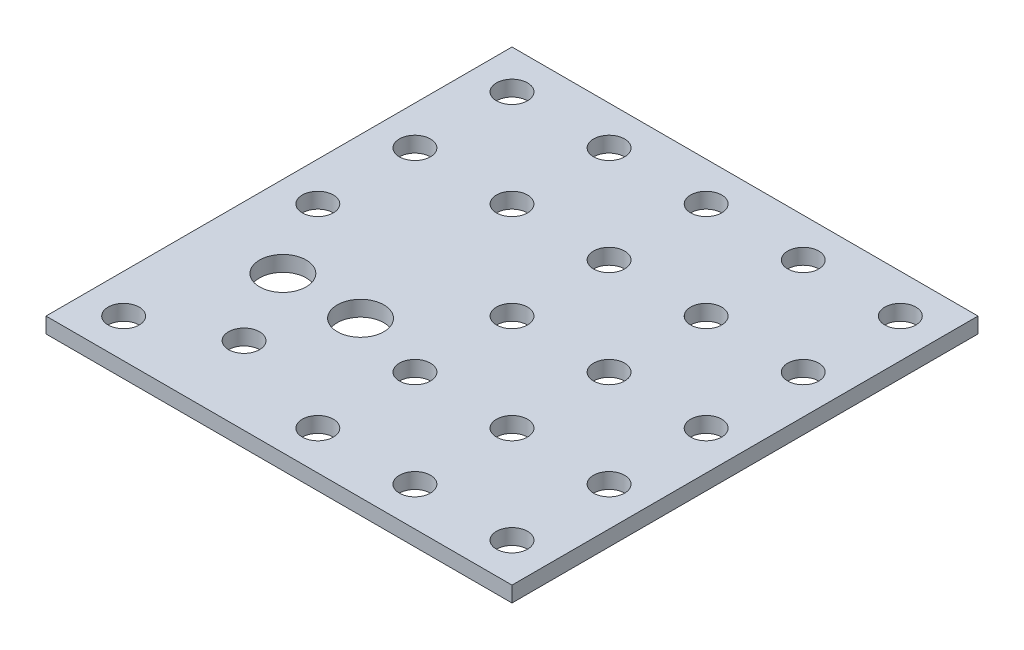
ISO-10303-21;
HEADER;
FILE_DESCRIPTION(('STEP AP214'),'2;1');
FILE_NAME('part.step','',(''),(''),'','','');
FILE_SCHEMA(('AUTOMOTIVE_DESIGN { 1 0 10303 214 1 1 1 1 }'));
ENDSEC;
DATA;
#1=APPLICATION_CONTEXT('core data for automotive mechanical design processes');
#2=APPLICATION_PROTOCOL_DEFINITION('international standard','automotive_design',2000,#1);
#3=PRODUCT_CONTEXT('',#1,'mechanical');
#4=PRODUCT('Part','Part','',(#3));
#5=PRODUCT_RELATED_PRODUCT_CATEGORY('part','',(#4));
#6=PRODUCT_DEFINITION_FORMATION('','',#4);
#7=PRODUCT_DEFINITION_CONTEXT('part definition',#1,'design');
#8=PRODUCT_DEFINITION('design','',#6,#7);
#9=PRODUCT_DEFINITION_SHAPE('','',#8);
#10=(LENGTH_UNIT() NAMED_UNIT(*) SI_UNIT(.MILLI.,.METRE.));
#11=(NAMED_UNIT(*) PLANE_ANGLE_UNIT() SI_UNIT($,.RADIAN.));
#12=(NAMED_UNIT(*) SI_UNIT($,.STERADIAN.) SOLID_ANGLE_UNIT());
#13=UNCERTAINTY_MEASURE_WITH_UNIT(LENGTH_MEASURE(1.E-05),#10,'distance_accuracy_value','');
#14=(GEOMETRIC_REPRESENTATION_CONTEXT(3) GLOBAL_UNCERTAINTY_ASSIGNED_CONTEXT((#13)) GLOBAL_UNIT_ASSIGNED_CONTEXT((#10,
#11,#12)) REPRESENTATION_CONTEXT('',''));
#15=CARTESIAN_POINT('',(0.,0.,0.));
#16=DIRECTION('',(0.,0.,1.));
#17=DIRECTION('',(1.,0.,0.));
#18=AXIS2_PLACEMENT_3D('',#15,#16,#17);
#19=CARTESIAN_POINT('',(0.,2.,0.));
#20=DIRECTION('',(1.,0.,0.));
#21=DIRECTION('',(0.,0.,-1.));
#22=AXIS2_PLACEMENT_3D('',#19,#20,#21);
#23=PLANE('',#22);
#24=DIRECTION('',(0.,0.,1.));
#25=VECTOR('',#24,1.);
#26=CARTESIAN_POINT('',(0.,0.,0.));
#27=LINE('',#26,#25);
#28=CARTESIAN_POINT('',(0.,0.,-60.));
#29=VERTEX_POINT('',#28);
#30=CARTESIAN_POINT('',(0.,0.,0.));
#31=VERTEX_POINT('',#30);
#32=EDGE_CURVE('E99',#29,#31,#27,.T.);
#33=ORIENTED_EDGE('',*,*,#32,.T.);
#34=DIRECTION('',(0.,-1.,0.));
#35=VECTOR('',#34,1.);
#36=CARTESIAN_POINT('',(0.,2.,0.));
#37=LINE('',#36,#35);
#38=CARTESIAN_POINT('',(0.,2.,0.));
#39=VERTEX_POINT('',#38);
#40=EDGE_CURVE('E11',#39,#31,#37,.T.);
#41=ORIENTED_EDGE('',*,*,#40,.F.);
#42=DIRECTION('',(0.,0.,1.));
#43=VECTOR('',#42,1.);
#44=CARTESIAN_POINT('',(0.,2.,0.));
#45=LINE('',#44,#43);
#46=CARTESIAN_POINT('',(0.,2.,-60.));
#47=VERTEX_POINT('',#46);
#48=EDGE_CURVE('E86',#47,#39,#45,.T.);
#49=ORIENTED_EDGE('',*,*,#48,.F.);
#50=DIRECTION('',(0.,-1.,0.));
#51=VECTOR('',#50,1.);
#52=CARTESIAN_POINT('',(0.,2.,-60.));
#53=LINE('',#52,#51);
#54=EDGE_CURVE('E95',#47,#29,#53,.T.);
#55=ORIENTED_EDGE('',*,*,#54,.T.);
#56=EDGE_LOOP('',(#33,#41,#49,#55));
#57=FACE_BOUND('',#56,.T.);
#58=ADVANCED_FACE('F33',(#57),#23,.F.);
#59=CARTESIAN_POINT('',(0.,2.,0.));
#60=DIRECTION('',(0.,0.,-1.));
#61=DIRECTION('',(-1.,0.,0.));
#62=AXIS2_PLACEMENT_3D('',#59,#60,#61);
#63=PLANE('',#62);
#64=DIRECTION('',(1.,0.,0.));
#65=VECTOR('',#64,1.);
#66=CARTESIAN_POINT('',(0.,0.,0.));
#67=LINE('',#66,#65);
#68=CARTESIAN_POINT('',(60.,0.,0.));
#69=VERTEX_POINT('',#68);
#70=EDGE_CURVE('E90',#31,#69,#67,.T.);
#71=ORIENTED_EDGE('',*,*,#70,.T.);
#72=DIRECTION('',(0.,-1.,0.));
#73=VECTOR('',#72,1.);
#74=CARTESIAN_POINT('',(60.,2.,0.));
#75=LINE('',#74,#73);
#76=CARTESIAN_POINT('',(60.,2.,0.));
#77=VERTEX_POINT('',#76);
#78=EDGE_CURVE('E42',#77,#69,#75,.T.);
#79=ORIENTED_EDGE('',*,*,#78,.F.);
#80=DIRECTION('',(1.,0.,0.));
#81=VECTOR('',#80,1.);
#82=CARTESIAN_POINT('',(0.,2.,0.));
#83=LINE('',#82,#81);
#84=EDGE_CURVE('E81',#39,#77,#83,.T.);
#85=ORIENTED_EDGE('',*,*,#84,.F.);
#86=ORIENTED_EDGE('',*,*,#40,.T.);
#87=EDGE_LOOP('',(#71,#79,#85,#86));
#88=FACE_BOUND('',#87,.T.);
#89=ADVANCED_FACE('F89',(#88),#63,.F.);
#90=CARTESIAN_POINT('',(60.,2.,0.));
#91=DIRECTION('',(-1.,0.,0.));
#92=DIRECTION('',(0.,0.,1.));
#93=AXIS2_PLACEMENT_3D('',#90,#91,#92);
#94=PLANE('',#93);
#95=DIRECTION('',(0.,0.,-1.));
#96=VECTOR('',#95,1.);
#97=CARTESIAN_POINT('',(60.,0.,0.));
#98=LINE('',#97,#96);
#99=CARTESIAN_POINT('',(60.,0.,-60.));
#100=VERTEX_POINT('',#99);
#101=EDGE_CURVE('E68',#69,#100,#98,.T.);
#102=ORIENTED_EDGE('',*,*,#101,.T.);
#103=DIRECTION('',(0.,-1.,0.));
#104=VECTOR('',#103,1.);
#105=CARTESIAN_POINT('',(60.,2.,-60.));
#106=LINE('',#105,#104);
#107=CARTESIAN_POINT('',(60.,2.,-60.));
#108=VERTEX_POINT('',#107);
#109=EDGE_CURVE('E91',#108,#100,#106,.T.);
#110=ORIENTED_EDGE('',*,*,#109,.F.);
#111=DIRECTION('',(0.,0.,-1.));
#112=VECTOR('',#111,1.);
#113=CARTESIAN_POINT('',(60.,2.,0.));
#114=LINE('',#113,#112);
#115=EDGE_CURVE('E84',#77,#108,#114,.T.);
#116=ORIENTED_EDGE('',*,*,#115,.F.);
#117=ORIENTED_EDGE('',*,*,#78,.T.);
#118=EDGE_LOOP('',(#102,#110,#116,#117));
#119=FACE_BOUND('',#118,.T.);
#120=ADVANCED_FACE('F93',(#119),#94,.F.);
#121=CARTESIAN_POINT('',(0.,2.,-60.));
#122=DIRECTION('',(0.,0.,1.));
#123=DIRECTION('',(1.,0.,0.));
#124=AXIS2_PLACEMENT_3D('',#121,#122,#123);
#125=PLANE('',#124);
#126=DIRECTION('',(-1.,0.,0.));
#127=VECTOR('',#126,1.);
#128=CARTESIAN_POINT('',(0.,0.,-60.));
#129=LINE('',#128,#127);
#130=EDGE_CURVE('E74',#100,#29,#129,.T.);
#131=ORIENTED_EDGE('',*,*,#130,.T.);
#132=ORIENTED_EDGE('',*,*,#54,.F.);
#133=DIRECTION('',(-1.,0.,0.));
#134=VECTOR('',#133,1.);
#135=CARTESIAN_POINT('',(0.,2.,-60.));
#136=LINE('',#135,#134);
#137=EDGE_CURVE('E51',#108,#47,#136,.T.);
#138=ORIENTED_EDGE('',*,*,#137,.F.);
#139=ORIENTED_EDGE('',*,*,#109,.T.);
#140=EDGE_LOOP('',(#131,#132,#138,#139));
#141=FACE_BOUND('',#140,.T.);
#142=ADVANCED_FACE('F167',(#141),#125,.F.);
#143=CARTESIAN_POINT('',(0.,2.,0.));
#144=DIRECTION('',(0.,-1.,0.));
#145=DIRECTION('',(0.,0.,-1.));
#146=AXIS2_PLACEMENT_3D('',#143,#144,#145);
#147=PLANE('',#146);
#148=CARTESIAN_POINT('',(30.,2.,-17.5));
#149=DIRECTION('',(0.,1.,0.));
#150=DIRECTION('',(0.,0.,1.));
#151=AXIS2_PLACEMENT_3D('',#148,#149,#150);
#152=CIRCLE('',#151,2.);
#153=CARTESIAN_POINT('',(30.,2.,-15.5));
#154=VERTEX_POINT('',#153);
#155=EDGE_CURVE('E452',#154,#154,#152,.T.);
#156=ORIENTED_EDGE('',*,*,#155,.F.);
#157=EDGE_LOOP('',(#156));
#158=FACE_BOUND('',#157,.T.);
#159=CARTESIAN_POINT('',(30.,2.,-42.5));
#160=DIRECTION('',(0.,1.,0.));
#161=DIRECTION('',(0.,0.,1.));
#162=AXIS2_PLACEMENT_3D('',#159,#160,#161);
#163=CIRCLE('',#162,2.);
#164=CARTESIAN_POINT('',(30.,2.,-40.5));
#165=VERTEX_POINT('',#164);
#166=EDGE_CURVE('E454',#165,#165,#163,.T.);
#167=ORIENTED_EDGE('',*,*,#166,.F.);
#168=EDGE_LOOP('',(#167));
#169=FACE_BOUND('',#168,.T.);
#170=CARTESIAN_POINT('',(5.,2.,-42.5));
#171=DIRECTION('',(0.,1.,0.));
#172=DIRECTION('',(0.,0.,1.));
#173=AXIS2_PLACEMENT_3D('',#170,#171,#172);
#174=CIRCLE('',#173,2.);
#175=CARTESIAN_POINT('',(5.,2.,-40.5));
#176=VERTEX_POINT('',#175);
#177=EDGE_CURVE('E620',#176,#176,#174,.T.);
#178=ORIENTED_EDGE('',*,*,#177,.F.);
#179=EDGE_LOOP('',(#178));
#180=FACE_BOUND('',#179,.T.);
#181=CARTESIAN_POINT('',(42.5,2.,-30.));
#182=DIRECTION('',(0.,1.,0.));
#183=DIRECTION('',(0.,0.,1.));
#184=AXIS2_PLACEMENT_3D('',#181,#182,#183);
#185=CIRCLE('',#184,2.);
#186=CARTESIAN_POINT('',(42.5,2.,-28.));
#187=VERTEX_POINT('',#186);
#188=EDGE_CURVE('E614',#187,#187,#185,.T.);
#189=ORIENTED_EDGE('',*,*,#188,.F.);
#190=EDGE_LOOP('',(#189));
#191=FACE_BOUND('',#190,.T.);
#192=CARTESIAN_POINT('',(42.5,2.,-5.));
#193=DIRECTION('',(0.,1.,0.));
#194=DIRECTION('',(0.,0.,1.));
#195=AXIS2_PLACEMENT_3D('',#192,#193,#194);
#196=CIRCLE('',#195,2.);
#197=CARTESIAN_POINT('',(42.5,2.,-3.));
#198=VERTEX_POINT('',#197);
#199=EDGE_CURVE('E608',#198,#198,#196,.T.);
#200=ORIENTED_EDGE('',*,*,#199,.F.);
#201=EDGE_LOOP('',(#200));
#202=FACE_BOUND('',#201,.T.);
#203=CARTESIAN_POINT('',(55.,2.,-42.5));
#204=DIRECTION('',(0.,1.,0.));
#205=DIRECTION('',(0.,0.,1.));
#206=AXIS2_PLACEMENT_3D('',#203,#204,#205);
#207=CIRCLE('',#206,2.);
#208=CARTESIAN_POINT('',(55.,2.,-40.5));
#209=VERTEX_POINT('',#208);
#210=EDGE_CURVE('E598',#209,#209,#207,.T.);
#211=ORIENTED_EDGE('',*,*,#210,.F.);
#212=EDGE_LOOP('',(#211));
#213=FACE_BOUND('',#212,.T.);
#214=CARTESIAN_POINT('',(42.5,2.,-55.));
#215=DIRECTION('',(0.,1.,0.));
#216=DIRECTION('',(0.,0.,1.));
#217=AXIS2_PLACEMENT_3D('',#214,#215,#216);
#218=CIRCLE('',#217,2.);
#219=CARTESIAN_POINT('',(42.5,2.,-53.));
#220=VERTEX_POINT('',#219);
#221=EDGE_CURVE('E482',#220,#220,#218,.T.);
#222=ORIENTED_EDGE('',*,*,#221,.F.);
#223=EDGE_LOOP('',(#222));
#224=FACE_BOUND('',#223,.T.);
#225=CARTESIAN_POINT('',(42.5,2.,-42.5));
#226=DIRECTION('',(0.,1.,0.));
#227=DIRECTION('',(0.,0.,1.));
#228=AXIS2_PLACEMENT_3D('',#225,#226,#227);
#229=CIRCLE('',#228,2.);
#230=CARTESIAN_POINT('',(42.5,2.,-40.5));
#231=VERTEX_POINT('',#230);
#232=EDGE_CURVE('E461',#231,#231,#229,.T.);
#233=ORIENTED_EDGE('',*,*,#232,.F.);
#234=EDGE_LOOP('',(#233));
#235=FACE_BOUND('',#234,.T.);
#236=CARTESIAN_POINT('',(17.5,2.,-42.5));
#237=DIRECTION('',(0.,1.,0.));
#238=DIRECTION('',(0.,0.,1.));
#239=AXIS2_PLACEMENT_3D('',#236,#237,#238);
#240=CIRCLE('',#239,2.);
#241=CARTESIAN_POINT('',(17.5,2.,-40.5));
#242=VERTEX_POINT('',#241);
#243=EDGE_CURVE('E462',#242,#242,#240,.T.);
#244=ORIENTED_EDGE('',*,*,#243,.F.);
#245=EDGE_LOOP('',(#244));
#246=FACE_BOUND('',#245,.T.);
#247=CARTESIAN_POINT('',(42.5,2.,-17.5));
#248=DIRECTION('',(0.,1.,0.));
#249=DIRECTION('',(0.,0.,1.));
#250=AXIS2_PLACEMENT_3D('',#247,#248,#249);
#251=CIRCLE('',#250,2.);
#252=CARTESIAN_POINT('',(42.5,2.,-15.5));
#253=VERTEX_POINT('',#252);
#254=EDGE_CURVE('E468',#253,#253,#251,.T.);
#255=ORIENTED_EDGE('',*,*,#254,.F.);
#256=EDGE_LOOP('',(#255));
#257=FACE_BOUND('',#256,.T.);
#258=CARTESIAN_POINT('',(55.,2.,-17.5));
#259=DIRECTION('',(0.,1.,0.));
#260=DIRECTION('',(0.,0.,1.));
#261=AXIS2_PLACEMENT_3D('',#258,#259,#260);
#262=CIRCLE('',#261,2.);
#263=CARTESIAN_POINT('',(55.,2.,-15.5));
#264=VERTEX_POINT('',#263);
#265=EDGE_CURVE('E474',#264,#264,#262,.T.);
#266=ORIENTED_EDGE('',*,*,#265,.F.);
#267=EDGE_LOOP('',(#266));
#268=FACE_BOUND('',#267,.T.);
#269=CARTESIAN_POINT('',(17.5,2.,-55.));
#270=DIRECTION('',(0.,1.,0.));
#271=DIRECTION('',(0.,0.,1.));
#272=AXIS2_PLACEMENT_3D('',#269,#270,#271);
#273=CIRCLE('',#272,2.);
#274=CARTESIAN_POINT('',(17.5,2.,-53.));
#275=VERTEX_POINT('',#274);
#276=EDGE_CURVE('E481',#275,#275,#273,.T.);
#277=ORIENTED_EDGE('',*,*,#276,.F.);
#278=EDGE_LOOP('',(#277));
#279=FACE_BOUND('',#278,.T.);
#280=CARTESIAN_POINT('',(30.,2.,-5.));
#281=DIRECTION('',(0.,1.,0.));
#282=DIRECTION('',(0.,0.,1.));
#283=AXIS2_PLACEMENT_3D('',#280,#281,#282);
#284=CIRCLE('',#283,2.);
#285=CARTESIAN_POINT('',(30.,2.,-3.));
#286=VERTEX_POINT('',#285);
#287=EDGE_CURVE('E502',#286,#286,#284,.T.);
#288=ORIENTED_EDGE('',*,*,#287,.F.);
#289=EDGE_LOOP('',(#288));
#290=FACE_BOUND('',#289,.T.);
#291=CARTESIAN_POINT('',(30.,2.,-30.));
#292=DIRECTION('',(0.,1.,0.));
#293=DIRECTION('',(0.,0.,1.));
#294=AXIS2_PLACEMENT_3D('',#291,#292,#293);
#295=CIRCLE('',#294,2.);
#296=CARTESIAN_POINT('',(30.,2.,-28.));
#297=VERTEX_POINT('',#296);
#298=EDGE_CURVE('E499',#297,#297,#295,.T.);
#299=ORIENTED_EDGE('',*,*,#298,.F.);
#300=EDGE_LOOP('',(#299));
#301=FACE_BOUND('',#300,.T.);
#302=CARTESIAN_POINT('',(55.,2.,-30.));
#303=DIRECTION('',(0.,1.,0.));
#304=DIRECTION('',(0.,0.,1.));
#305=AXIS2_PLACEMENT_3D('',#302,#303,#304);
#306=CIRCLE('',#305,2.);
#307=CARTESIAN_POINT('',(55.,2.,-28.));
#308=VERTEX_POINT('',#307);
#309=EDGE_CURVE('E496',#308,#308,#306,.T.);
#310=ORIENTED_EDGE('',*,*,#309,.F.);
#311=EDGE_LOOP('',(#310));
#312=FACE_BOUND('',#311,.T.);
#313=CARTESIAN_POINT('',(5.,2.,-30.));
#314=DIRECTION('',(0.,1.,0.));
#315=DIRECTION('',(0.,0.,1.));
#316=AXIS2_PLACEMENT_3D('',#313,#314,#315);
#317=CIRCLE('',#316,2.);
#318=CARTESIAN_POINT('',(5.,2.,-28.));
#319=VERTEX_POINT('',#318);
#320=EDGE_CURVE('E493',#319,#319,#317,.T.);
#321=ORIENTED_EDGE('',*,*,#320,.F.);
#322=EDGE_LOOP('',(#321));
#323=FACE_BOUND('',#322,.T.);
#324=CARTESIAN_POINT('',(30.,2.,-55.));
#325=DIRECTION('',(0.,1.,0.));
#326=DIRECTION('',(0.,0.,1.));
#327=AXIS2_PLACEMENT_3D('',#324,#325,#326);
#328=CIRCLE('',#327,2.);
#329=CARTESIAN_POINT('',(30.,2.,-53.));
#330=VERTEX_POINT('',#329);
#331=EDGE_CURVE('E154',#330,#330,#328,.T.);
#332=ORIENTED_EDGE('',*,*,#331,.F.);
#333=EDGE_LOOP('',(#332));
#334=FACE_BOUND('',#333,.T.);
#335=CARTESIAN_POINT('',(5.,2.,-55.));
#336=DIRECTION('',(0.,1.,0.));
#337=DIRECTION('',(0.,0.,1.));
#338=AXIS2_PLACEMENT_3D('',#335,#336,#337);
#339=CIRCLE('',#338,2.);
#340=CARTESIAN_POINT('',(5.,2.,-53.));
#341=VERTEX_POINT('',#340);
#342=EDGE_CURVE('E511',#341,#341,#339,.T.);
#343=ORIENTED_EDGE('',*,*,#342,.F.);
#344=EDGE_LOOP('',(#343));
#345=FACE_BOUND('',#344,.T.);
#346=CARTESIAN_POINT('',(55.,2.,-55.));
#347=DIRECTION('',(0.,1.,0.));
#348=DIRECTION('',(0.,0.,1.));
#349=AXIS2_PLACEMENT_3D('',#346,#347,#348);
#350=CIRCLE('',#349,2.);
#351=CARTESIAN_POINT('',(55.,2.,-53.));
#352=VERTEX_POINT('',#351);
#353=EDGE_CURVE('E509',#352,#352,#350,.T.);
#354=ORIENTED_EDGE('',*,*,#353,.F.);
#355=EDGE_LOOP('',(#354));
#356=FACE_BOUND('',#355,.T.);
#357=CARTESIAN_POINT('',(55.,2.,-5.));
#358=DIRECTION('',(0.,1.,0.));
#359=DIRECTION('',(0.,0.,1.));
#360=AXIS2_PLACEMENT_3D('',#357,#358,#359);
#361=CIRCLE('',#360,2.);
#362=CARTESIAN_POINT('',(55.,2.,-3.));
#363=VERTEX_POINT('',#362);
#364=EDGE_CURVE('E127',#363,#363,#361,.T.);
#365=ORIENTED_EDGE('',*,*,#364,.F.);
#366=EDGE_LOOP('',(#365));
#367=FACE_BOUND('',#366,.T.);
#368=CARTESIAN_POINT('',(5.,2.,-5.));
#369=DIRECTION('',(0.,1.,0.));
#370=DIRECTION('',(0.,0.,1.));
#371=AXIS2_PLACEMENT_3D('',#368,#369,#370);
#372=CIRCLE('',#371,2.);
#373=CARTESIAN_POINT('',(5.,2.,-3.));
#374=VERTEX_POINT('',#373);
#375=EDGE_CURVE('E122',#374,#374,#372,.T.);
#376=ORIENTED_EDGE('',*,*,#375,.F.);
#377=EDGE_LOOP('',(#376));
#378=FACE_BOUND('',#377,.T.);
#379=CARTESIAN_POINT('',(20.5,2.,-20.));
#380=DIRECTION('',(0.,1.,0.));
#381=DIRECTION('',(0.,0.,1.));
#382=AXIS2_PLACEMENT_3D('',#379,#380,#381);
#383=CIRCLE('',#382,3.);
#384=CARTESIAN_POINT('',(20.5,2.,-17.));
#385=VERTEX_POINT('',#384);
#386=EDGE_CURVE('E115',#385,#385,#383,.T.);
#387=ORIENTED_EDGE('',*,*,#386,.F.);
#388=EDGE_LOOP('',(#387));
#389=FACE_BOUND('',#388,.T.);
#390=CARTESIAN_POINT('',(15.5,2.,-10.));
#391=DIRECTION('',(0.,1.,0.));
#392=DIRECTION('',(0.,0.,1.));
#393=AXIS2_PLACEMENT_3D('',#390,#391,#392);
#394=CIRCLE('',#393,2.);
#395=CARTESIAN_POINT('',(15.5,2.,-8.));
#396=VERTEX_POINT('',#395);
#397=EDGE_CURVE('E121',#396,#396,#394,.T.);
#398=ORIENTED_EDGE('',*,*,#397,.F.);
#399=EDGE_LOOP('',(#398));
#400=FACE_BOUND('',#399,.T.);
#401=CARTESIAN_POINT('',(10.5,2.,-20.));
#402=DIRECTION('',(0.,1.,0.));
#403=DIRECTION('',(0.,0.,1.));
#404=AXIS2_PLACEMENT_3D('',#401,#402,#403);
#405=CIRCLE('',#404,3.);
#406=CARTESIAN_POINT('',(10.5,2.,-17.));
#407=VERTEX_POINT('',#406);
#408=EDGE_CURVE('E110',#407,#407,#405,.T.);
#409=ORIENTED_EDGE('',*,*,#408,.F.);
#410=EDGE_LOOP('',(#409));
#411=FACE_BOUND('',#410,.T.);
#412=ORIENTED_EDGE('',*,*,#48,.T.);
#413=ORIENTED_EDGE('',*,*,#84,.T.);
#414=ORIENTED_EDGE('',*,*,#115,.T.);
#415=ORIENTED_EDGE('',*,*,#137,.T.);
#416=EDGE_LOOP('',(#412,#413,#414,#415));
#417=FACE_BOUND('',#416,.T.);
#418=ADVANCED_FACE('F82',(#158,#169,#180,#191,#202,#213,#224,#235,#246,#257,#268,#279,#290,#301,
#312,#323,#334,#345,#356,#367,#378,#389,#400,#411,#417),#147,.F.);
#419=CARTESIAN_POINT('',(0.,0.,0.));
#420=DIRECTION('',(0.,-1.,0.));
#421=DIRECTION('',(0.,0.,-1.));
#422=AXIS2_PLACEMENT_3D('',#419,#420,#421);
#423=PLANE('',#422);
#424=CARTESIAN_POINT('',(30.,0.,-17.5));
#425=DIRECTION('',(0.,1.,0.));
#426=DIRECTION('',(0.,0.,1.));
#427=AXIS2_PLACEMENT_3D('',#424,#425,#426);
#428=CIRCLE('',#427,2.);
#429=CARTESIAN_POINT('',(30.,0.,-15.5));
#430=VERTEX_POINT('',#429);
#431=EDGE_CURVE('E450',#430,#430,#428,.T.);
#432=ORIENTED_EDGE('',*,*,#431,.T.);
#433=EDGE_LOOP('',(#432));
#434=FACE_BOUND('',#433,.T.);
#435=CARTESIAN_POINT('',(30.,0.,-42.5));
#436=DIRECTION('',(0.,1.,0.));
#437=DIRECTION('',(0.,0.,1.));
#438=AXIS2_PLACEMENT_3D('',#435,#436,#437);
#439=CIRCLE('',#438,2.);
#440=CARTESIAN_POINT('',(30.,0.,-40.5));
#441=VERTEX_POINT('',#440);
#442=EDGE_CURVE('E623',#441,#441,#439,.T.);
#443=ORIENTED_EDGE('',*,*,#442,.T.);
#444=EDGE_LOOP('',(#443));
#445=FACE_BOUND('',#444,.T.);
#446=CARTESIAN_POINT('',(5.,0.,-42.5));
#447=DIRECTION('',(0.,1.,0.));
#448=DIRECTION('',(0.,0.,1.));
#449=AXIS2_PLACEMENT_3D('',#446,#447,#448);
#450=CIRCLE('',#449,2.);
#451=CARTESIAN_POINT('',(5.,0.,-40.5));
#452=VERTEX_POINT('',#451);
#453=EDGE_CURVE('E617',#452,#452,#450,.T.);
#454=ORIENTED_EDGE('',*,*,#453,.T.);
#455=EDGE_LOOP('',(#454));
#456=FACE_BOUND('',#455,.T.);
#457=CARTESIAN_POINT('',(42.5,0.,-30.));
#458=DIRECTION('',(0.,1.,0.));
#459=DIRECTION('',(0.,0.,1.));
#460=AXIS2_PLACEMENT_3D('',#457,#458,#459);
#461=CIRCLE('',#460,2.);
#462=CARTESIAN_POINT('',(42.5,0.,-28.));
#463=VERTEX_POINT('',#462);
#464=EDGE_CURVE('E611',#463,#463,#461,.T.);
#465=ORIENTED_EDGE('',*,*,#464,.T.);
#466=EDGE_LOOP('',(#465));
#467=FACE_BOUND('',#466,.T.);
#468=CARTESIAN_POINT('',(42.5,0.,-5.));
#469=DIRECTION('',(0.,1.,0.));
#470=DIRECTION('',(0.,0.,1.));
#471=AXIS2_PLACEMENT_3D('',#468,#469,#470);
#472=CIRCLE('',#471,2.);
#473=CARTESIAN_POINT('',(42.5,0.,-3.));
#474=VERTEX_POINT('',#473);
#475=EDGE_CURVE('E603',#474,#474,#472,.T.);
#476=ORIENTED_EDGE('',*,*,#475,.T.);
#477=EDGE_LOOP('',(#476));
#478=FACE_BOUND('',#477,.T.);
#479=CARTESIAN_POINT('',(55.,0.,-42.5));
#480=DIRECTION('',(0.,1.,0.));
#481=DIRECTION('',(0.,0.,1.));
#482=AXIS2_PLACEMENT_3D('',#479,#480,#481);
#483=CIRCLE('',#482,2.);
#484=CARTESIAN_POINT('',(55.,0.,-40.5));
#485=VERTEX_POINT('',#484);
#486=EDGE_CURVE('E477',#485,#485,#483,.T.);
#487=ORIENTED_EDGE('',*,*,#486,.T.);
#488=EDGE_LOOP('',(#487));
#489=FACE_BOUND('',#488,.T.);
#490=CARTESIAN_POINT('',(42.5,0.,-55.));
#491=DIRECTION('',(0.,1.,0.));
#492=DIRECTION('',(0.,0.,1.));
#493=AXIS2_PLACEMENT_3D('',#490,#491,#492);
#494=CIRCLE('',#493,2.);
#495=CARTESIAN_POINT('',(42.5,0.,-53.));
#496=VERTEX_POINT('',#495);
#497=EDGE_CURVE('E478',#496,#496,#494,.T.);
#498=ORIENTED_EDGE('',*,*,#497,.T.);
#499=EDGE_LOOP('',(#498));
#500=FACE_BOUND('',#499,.T.);
#501=CARTESIAN_POINT('',(42.5,0.,-42.5));
#502=DIRECTION('',(0.,1.,0.));
#503=DIRECTION('',(0.,0.,1.));
#504=AXIS2_PLACEMENT_3D('',#501,#502,#503);
#505=CIRCLE('',#504,2.);
#506=CARTESIAN_POINT('',(42.5,0.,-40.5));
#507=VERTEX_POINT('',#506);
#508=EDGE_CURVE('E485',#507,#507,#505,.T.);
#509=ORIENTED_EDGE('',*,*,#508,.T.);
#510=EDGE_LOOP('',(#509));
#511=FACE_BOUND('',#510,.T.);
#512=CARTESIAN_POINT('',(17.5,0.,-42.5));
#513=DIRECTION('',(0.,1.,0.));
#514=DIRECTION('',(0.,0.,1.));
#515=AXIS2_PLACEMENT_3D('',#512,#513,#514);
#516=CIRCLE('',#515,2.);
#517=CARTESIAN_POINT('',(17.5,0.,-40.5));
#518=VERTEX_POINT('',#517);
#519=EDGE_CURVE('E458',#518,#518,#516,.T.);
#520=ORIENTED_EDGE('',*,*,#519,.T.);
#521=EDGE_LOOP('',(#520));
#522=FACE_BOUND('',#521,.T.);
#523=CARTESIAN_POINT('',(42.5,0.,-17.5));
#524=DIRECTION('',(0.,1.,0.));
#525=DIRECTION('',(0.,0.,1.));
#526=AXIS2_PLACEMENT_3D('',#523,#524,#525);
#527=CIRCLE('',#526,2.);
#528=CARTESIAN_POINT('',(42.5,0.,-15.5));
#529=VERTEX_POINT('',#528);
#530=EDGE_CURVE('E465',#529,#529,#527,.T.);
#531=ORIENTED_EDGE('',*,*,#530,.T.);
#532=EDGE_LOOP('',(#531));
#533=FACE_BOUND('',#532,.T.);
#534=CARTESIAN_POINT('',(55.,0.,-17.5));
#535=DIRECTION('',(0.,1.,0.));
#536=DIRECTION('',(0.,0.,1.));
#537=AXIS2_PLACEMENT_3D('',#534,#535,#536);
#538=CIRCLE('',#537,2.);
#539=CARTESIAN_POINT('',(55.,0.,-15.5));
#540=VERTEX_POINT('',#539);
#541=EDGE_CURVE('E471',#540,#540,#538,.T.);
#542=ORIENTED_EDGE('',*,*,#541,.T.);
#543=EDGE_LOOP('',(#542));
#544=FACE_BOUND('',#543,.T.);
#545=CARTESIAN_POINT('',(17.5,0.,-55.));
#546=DIRECTION('',(0.,1.,0.));
#547=DIRECTION('',(0.,0.,1.));
#548=AXIS2_PLACEMENT_3D('',#545,#546,#547);
#549=CIRCLE('',#548,2.);
#550=CARTESIAN_POINT('',(17.5,0.,-53.));
#551=VERTEX_POINT('',#550);
#552=EDGE_CURVE('E490',#551,#551,#549,.T.);
#553=ORIENTED_EDGE('',*,*,#552,.T.);
#554=EDGE_LOOP('',(#553));
#555=FACE_BOUND('',#554,.T.);
#556=CARTESIAN_POINT('',(30.,0.,-5.));
#557=DIRECTION('',(0.,-1.,0.));
#558=DIRECTION('',(0.,0.,-1.));
#559=AXIS2_PLACEMENT_3D('',#556,#557,#558);
#560=CIRCLE('',#559,2.);
#561=CARTESIAN_POINT('',(30.,0.,-7.));
#562=VERTEX_POINT('',#561);
#563=EDGE_CURVE('E36',#562,#562,#560,.T.);
#564=ORIENTED_EDGE('',*,*,#563,.F.);
#565=EDGE_LOOP('',(#564));
#566=FACE_BOUND('',#565,.T.);
#567=CARTESIAN_POINT('',(30.,0.,-30.));
#568=DIRECTION('',(0.,-1.,0.));
#569=DIRECTION('',(0.,0.,-1.));
#570=AXIS2_PLACEMENT_3D('',#567,#568,#569);
#571=CIRCLE('',#570,2.);
#572=CARTESIAN_POINT('',(30.,0.,-32.));
#573=VERTEX_POINT('',#572);
#574=EDGE_CURVE('E141',#573,#573,#571,.T.);
#575=ORIENTED_EDGE('',*,*,#574,.F.);
#576=EDGE_LOOP('',(#575));
#577=FACE_BOUND('',#576,.T.);
#578=CARTESIAN_POINT('',(55.,0.,-30.));
#579=DIRECTION('',(0.,-1.,0.));
#580=DIRECTION('',(0.,0.,-1.));
#581=AXIS2_PLACEMENT_3D('',#578,#579,#580);
#582=CIRCLE('',#581,2.);
#583=CARTESIAN_POINT('',(55.,0.,-32.));
#584=VERTEX_POINT('',#583);
#585=EDGE_CURVE('E139',#584,#584,#582,.T.);
#586=ORIENTED_EDGE('',*,*,#585,.F.);
#587=EDGE_LOOP('',(#586));
#588=FACE_BOUND('',#587,.T.);
#589=CARTESIAN_POINT('',(5.,0.,-30.));
#590=DIRECTION('',(0.,-1.,0.));
#591=DIRECTION('',(0.,0.,-1.));
#592=AXIS2_PLACEMENT_3D('',#589,#590,#591);
#593=CIRCLE('',#592,2.);
#594=CARTESIAN_POINT('',(5.,0.,-32.));
#595=VERTEX_POINT('',#594);
#596=EDGE_CURVE('E136',#595,#595,#593,.T.);
#597=ORIENTED_EDGE('',*,*,#596,.F.);
#598=EDGE_LOOP('',(#597));
#599=FACE_BOUND('',#598,.T.);
#600=CARTESIAN_POINT('',(30.,0.,-55.));
#601=DIRECTION('',(0.,-1.,0.));
#602=DIRECTION('',(0.,0.,-1.));
#603=AXIS2_PLACEMENT_3D('',#600,#601,#602);
#604=CIRCLE('',#603,2.);
#605=CARTESIAN_POINT('',(30.,0.,-57.));
#606=VERTEX_POINT('',#605);
#607=EDGE_CURVE('E133',#606,#606,#604,.T.);
#608=ORIENTED_EDGE('',*,*,#607,.F.);
#609=EDGE_LOOP('',(#608));
#610=FACE_BOUND('',#609,.T.);
#611=CARTESIAN_POINT('',(5.,0.,-55.));
#612=DIRECTION('',(0.,-1.,0.));
#613=DIRECTION('',(0.,0.,-1.));
#614=AXIS2_PLACEMENT_3D('',#611,#612,#613);
#615=CIRCLE('',#614,2.);
#616=CARTESIAN_POINT('',(5.,0.,-57.));
#617=VERTEX_POINT('',#616);
#618=EDGE_CURVE('E130',#617,#617,#615,.T.);
#619=ORIENTED_EDGE('',*,*,#618,.F.);
#620=EDGE_LOOP('',(#619));
#621=FACE_BOUND('',#620,.T.);
#622=CARTESIAN_POINT('',(55.,0.,-55.));
#623=DIRECTION('',(0.,-1.,0.));
#624=DIRECTION('',(0.,0.,-1.));
#625=AXIS2_PLACEMENT_3D('',#622,#623,#624);
#626=CIRCLE('',#625,2.);
#627=CARTESIAN_POINT('',(55.,0.,-57.));
#628=VERTEX_POINT('',#627);
#629=EDGE_CURVE('E126',#628,#628,#626,.T.);
#630=ORIENTED_EDGE('',*,*,#629,.F.);
#631=EDGE_LOOP('',(#630));
#632=FACE_BOUND('',#631,.T.);
#633=CARTESIAN_POINT('',(55.,0.,-5.));
#634=DIRECTION('',(0.,-1.,0.));
#635=DIRECTION('',(0.,0.,-1.));
#636=AXIS2_PLACEMENT_3D('',#633,#634,#635);
#637=CIRCLE('',#636,2.);
#638=CARTESIAN_POINT('',(55.,0.,-7.));
#639=VERTEX_POINT('',#638);
#640=EDGE_CURVE('E123',#639,#639,#637,.T.);
#641=ORIENTED_EDGE('',*,*,#640,.F.);
#642=EDGE_LOOP('',(#641));
#643=FACE_BOUND('',#642,.T.);
#644=CARTESIAN_POINT('',(5.,0.,-5.));
#645=DIRECTION('',(0.,-1.,0.));
#646=DIRECTION('',(0.,0.,-1.));
#647=AXIS2_PLACEMENT_3D('',#644,#645,#646);
#648=CIRCLE('',#647,2.);
#649=CARTESIAN_POINT('',(5.,0.,-7.));
#650=VERTEX_POINT('',#649);
#651=EDGE_CURVE('E118',#650,#650,#648,.T.);
#652=ORIENTED_EDGE('',*,*,#651,.F.);
#653=EDGE_LOOP('',(#652));
#654=FACE_BOUND('',#653,.T.);
#655=CARTESIAN_POINT('',(20.5,0.,-20.));
#656=DIRECTION('',(0.,-1.,0.));
#657=DIRECTION('',(0.,0.,-1.));
#658=AXIS2_PLACEMENT_3D('',#655,#656,#657);
#659=CIRCLE('',#658,3.);
#660=CARTESIAN_POINT('',(20.5,0.,-23.));
#661=VERTEX_POINT('',#660);
#662=EDGE_CURVE('E114',#661,#661,#659,.T.);
#663=ORIENTED_EDGE('',*,*,#662,.F.);
#664=EDGE_LOOP('',(#663));
#665=FACE_BOUND('',#664,.T.);
#666=CARTESIAN_POINT('',(15.5,0.,-10.));
#667=DIRECTION('',(0.,-1.,0.));
#668=DIRECTION('',(0.,0.,-1.));
#669=AXIS2_PLACEMENT_3D('',#666,#667,#668);
#670=CIRCLE('',#669,2.);
#671=CARTESIAN_POINT('',(15.5,0.,-12.));
#672=VERTEX_POINT('',#671);
#673=EDGE_CURVE('E111',#672,#672,#670,.T.);
#674=ORIENTED_EDGE('',*,*,#673,.F.);
#675=EDGE_LOOP('',(#674));
#676=FACE_BOUND('',#675,.T.);
#677=CARTESIAN_POINT('',(10.5,0.,-20.));
#678=DIRECTION('',(0.,-1.,0.));
#679=DIRECTION('',(0.,0.,-1.));
#680=AXIS2_PLACEMENT_3D('',#677,#678,#679);
#681=CIRCLE('',#680,3.);
#682=CARTESIAN_POINT('',(10.5,0.,-23.));
#683=VERTEX_POINT('',#682);
#684=EDGE_CURVE('E102',#683,#683,#681,.T.);
#685=ORIENTED_EDGE('',*,*,#684,.F.);
#686=EDGE_LOOP('',(#685));
#687=FACE_BOUND('',#686,.T.);
#688=ORIENTED_EDGE('',*,*,#32,.F.);
#689=ORIENTED_EDGE('',*,*,#130,.F.);
#690=ORIENTED_EDGE('',*,*,#101,.F.);
#691=ORIENTED_EDGE('',*,*,#70,.F.);
#692=EDGE_LOOP('',(#688,#689,#690,#691));
#693=FACE_BOUND('',#692,.T.);
#694=ADVANCED_FACE('F166',(#434,#445,#456,#467,#478,#489,#500,#511,#522,#533,#544,#555,#566,
#577,#588,#599,#610,#621,#632,#643,#654,#665,#676,#687,#693),#423,.T.);
#695=CARTESIAN_POINT('',(10.5,-8.,-20.));
#696=DIRECTION('',(0.,1.,0.));
#697=DIRECTION('',(0.,0.,1.));
#698=AXIS2_PLACEMENT_3D('',#695,#696,#697);
#699=CYLINDRICAL_SURFACE('',#698,3.);
#700=ORIENTED_EDGE('',*,*,#684,.T.);
#701=EDGE_LOOP('',(#700));
#702=FACE_BOUND('',#701,.T.);
#703=ORIENTED_EDGE('',*,*,#408,.T.);
#704=EDGE_LOOP('',(#703));
#705=FACE_BOUND('',#704,.T.);
#706=ADVANCED_FACE('F163',(#702,#705),#699,.F.);
#707=CARTESIAN_POINT('',(15.5,-8.,-10.));
#708=DIRECTION('',(0.,1.,0.));
#709=DIRECTION('',(0.,0.,1.));
#710=AXIS2_PLACEMENT_3D('',#707,#708,#709);
#711=CYLINDRICAL_SURFACE('',#710,2.);
#712=ORIENTED_EDGE('',*,*,#673,.T.);
#713=EDGE_LOOP('',(#712));
#714=FACE_BOUND('',#713,.T.);
#715=ORIENTED_EDGE('',*,*,#397,.T.);
#716=EDGE_LOOP('',(#715));
#717=FACE_BOUND('',#716,.T.);
#718=ADVANCED_FACE('F207',(#714,#717),#711,.F.);
#719=CARTESIAN_POINT('',(20.5,-8.,-20.));
#720=DIRECTION('',(0.,1.,0.));
#721=DIRECTION('',(0.,0.,1.));
#722=AXIS2_PLACEMENT_3D('',#719,#720,#721);
#723=CYLINDRICAL_SURFACE('',#722,3.);
#724=ORIENTED_EDGE('',*,*,#662,.T.);
#725=EDGE_LOOP('',(#724));
#726=FACE_BOUND('',#725,.T.);
#727=ORIENTED_EDGE('',*,*,#386,.T.);
#728=EDGE_LOOP('',(#727));
#729=FACE_BOUND('',#728,.T.);
#730=ADVANCED_FACE('F217',(#726,#729),#723,.F.);
#731=CARTESIAN_POINT('',(5.,-8.,-5.));
#732=DIRECTION('',(0.,1.,0.));
#733=DIRECTION('',(0.,0.,1.));
#734=AXIS2_PLACEMENT_3D('',#731,#732,#733);
#735=CYLINDRICAL_SURFACE('',#734,2.);
#736=ORIENTED_EDGE('',*,*,#651,.T.);
#737=EDGE_LOOP('',(#736));
#738=FACE_BOUND('',#737,.T.);
#739=ORIENTED_EDGE('',*,*,#375,.T.);
#740=EDGE_LOOP('',(#739));
#741=FACE_BOUND('',#740,.T.);
#742=ADVANCED_FACE('F227',(#738,#741),#735,.F.);
#743=CARTESIAN_POINT('',(55.,-8.,-5.));
#744=DIRECTION('',(0.,1.,0.));
#745=DIRECTION('',(0.,0.,1.));
#746=AXIS2_PLACEMENT_3D('',#743,#744,#745);
#747=CYLINDRICAL_SURFACE('',#746,2.);
#748=ORIENTED_EDGE('',*,*,#640,.T.);
#749=EDGE_LOOP('',(#748));
#750=FACE_BOUND('',#749,.T.);
#751=ORIENTED_EDGE('',*,*,#364,.T.);
#752=EDGE_LOOP('',(#751));
#753=FACE_BOUND('',#752,.T.);
#754=ADVANCED_FACE('F237',(#750,#753),#747,.F.);
#755=CARTESIAN_POINT('',(55.,-8.,-55.));
#756=DIRECTION('',(0.,1.,0.));
#757=DIRECTION('',(0.,0.,1.));
#758=AXIS2_PLACEMENT_3D('',#755,#756,#757);
#759=CYLINDRICAL_SURFACE('',#758,2.);
#760=ORIENTED_EDGE('',*,*,#629,.T.);
#761=EDGE_LOOP('',(#760));
#762=FACE_BOUND('',#761,.T.);
#763=ORIENTED_EDGE('',*,*,#353,.T.);
#764=EDGE_LOOP('',(#763));
#765=FACE_BOUND('',#764,.T.);
#766=ADVANCED_FACE('F247',(#762,#765),#759,.F.);
#767=CARTESIAN_POINT('',(5.,-8.,-55.));
#768=DIRECTION('',(0.,1.,0.));
#769=DIRECTION('',(0.,0.,1.));
#770=AXIS2_PLACEMENT_3D('',#767,#768,#769);
#771=CYLINDRICAL_SURFACE('',#770,2.);
#772=ORIENTED_EDGE('',*,*,#618,.T.);
#773=EDGE_LOOP('',(#772));
#774=FACE_BOUND('',#773,.T.);
#775=ORIENTED_EDGE('',*,*,#342,.T.);
#776=EDGE_LOOP('',(#775));
#777=FACE_BOUND('',#776,.T.);
#778=ADVANCED_FACE('F257',(#774,#777),#771,.F.);
#779=CARTESIAN_POINT('',(30.,-8.,-55.));
#780=DIRECTION('',(0.,1.,0.));
#781=DIRECTION('',(0.,0.,1.));
#782=AXIS2_PLACEMENT_3D('',#779,#780,#781);
#783=CYLINDRICAL_SURFACE('',#782,2.);
#784=ORIENTED_EDGE('',*,*,#607,.T.);
#785=EDGE_LOOP('',(#784));
#786=FACE_BOUND('',#785,.T.);
#787=ORIENTED_EDGE('',*,*,#331,.T.);
#788=EDGE_LOOP('',(#787));
#789=FACE_BOUND('',#788,.T.);
#790=ADVANCED_FACE('F267',(#786,#789),#783,.F.);
#791=CARTESIAN_POINT('',(5.,-8.,-30.));
#792=DIRECTION('',(0.,1.,0.));
#793=DIRECTION('',(0.,0.,1.));
#794=AXIS2_PLACEMENT_3D('',#791,#792,#793);
#795=CYLINDRICAL_SURFACE('',#794,2.);
#796=ORIENTED_EDGE('',*,*,#596,.T.);
#797=EDGE_LOOP('',(#796));
#798=FACE_BOUND('',#797,.T.);
#799=ORIENTED_EDGE('',*,*,#320,.T.);
#800=EDGE_LOOP('',(#799));
#801=FACE_BOUND('',#800,.T.);
#802=ADVANCED_FACE('F277',(#798,#801),#795,.F.);
#803=CARTESIAN_POINT('',(55.,-8.,-30.));
#804=DIRECTION('',(0.,1.,0.));
#805=DIRECTION('',(0.,0.,1.));
#806=AXIS2_PLACEMENT_3D('',#803,#804,#805);
#807=CYLINDRICAL_SURFACE('',#806,2.);
#808=ORIENTED_EDGE('',*,*,#585,.T.);
#809=EDGE_LOOP('',(#808));
#810=FACE_BOUND('',#809,.T.);
#811=ORIENTED_EDGE('',*,*,#309,.T.);
#812=EDGE_LOOP('',(#811));
#813=FACE_BOUND('',#812,.T.);
#814=ADVANCED_FACE('F287',(#810,#813),#807,.F.);
#815=CARTESIAN_POINT('',(30.,-8.,-30.));
#816=DIRECTION('',(0.,1.,0.));
#817=DIRECTION('',(0.,0.,1.));
#818=AXIS2_PLACEMENT_3D('',#815,#816,#817);
#819=CYLINDRICAL_SURFACE('',#818,2.);
#820=ORIENTED_EDGE('',*,*,#574,.T.);
#821=EDGE_LOOP('',(#820));
#822=FACE_BOUND('',#821,.T.);
#823=ORIENTED_EDGE('',*,*,#298,.T.);
#824=EDGE_LOOP('',(#823));
#825=FACE_BOUND('',#824,.T.);
#826=ADVANCED_FACE('F297',(#822,#825),#819,.F.);
#827=CARTESIAN_POINT('',(30.,-8.,-5.));
#828=DIRECTION('',(0.,1.,0.));
#829=DIRECTION('',(0.,0.,1.));
#830=AXIS2_PLACEMENT_3D('',#827,#828,#829);
#831=CYLINDRICAL_SURFACE('',#830,2.);
#832=ORIENTED_EDGE('',*,*,#563,.T.);
#833=EDGE_LOOP('',(#832));
#834=FACE_BOUND('',#833,.T.);
#835=ORIENTED_EDGE('',*,*,#287,.T.);
#836=EDGE_LOOP('',(#835));
#837=FACE_BOUND('',#836,.T.);
#838=ADVANCED_FACE('F307',(#834,#837),#831,.F.);
#839=CARTESIAN_POINT('',(17.5,0.,-55.));
#840=DIRECTION('',(0.,1.,0.));
#841=DIRECTION('',(0.,0.,1.));
#842=AXIS2_PLACEMENT_3D('',#839,#840,#841);
#843=CYLINDRICAL_SURFACE('',#842,2.);
#844=ORIENTED_EDGE('',*,*,#552,.F.);
#845=EDGE_LOOP('',(#844));
#846=FACE_BOUND('',#845,.T.);
#847=ORIENTED_EDGE('',*,*,#276,.T.);
#848=EDGE_LOOP('',(#847));
#849=FACE_BOUND('',#848,.T.);
#850=ADVANCED_FACE('F315',(#846,#849),#843,.F.);
#851=CARTESIAN_POINT('',(55.,0.,-17.5));
#852=DIRECTION('',(0.,1.,0.));
#853=DIRECTION('',(0.,0.,1.));
#854=AXIS2_PLACEMENT_3D('',#851,#852,#853);
#855=CYLINDRICAL_SURFACE('',#854,2.);
#856=ORIENTED_EDGE('',*,*,#541,.F.);
#857=EDGE_LOOP('',(#856));
#858=FACE_BOUND('',#857,.T.);
#859=ORIENTED_EDGE('',*,*,#265,.T.);
#860=EDGE_LOOP('',(#859));
#861=FACE_BOUND('',#860,.T.);
#862=ADVANCED_FACE('F333',(#858,#861),#855,.F.);
#863=CARTESIAN_POINT('',(42.5,0.,-17.5));
#864=DIRECTION('',(0.,1.,0.));
#865=DIRECTION('',(0.,0.,1.));
#866=AXIS2_PLACEMENT_3D('',#863,#864,#865);
#867=CYLINDRICAL_SURFACE('',#866,2.);
#868=ORIENTED_EDGE('',*,*,#530,.F.);
#869=EDGE_LOOP('',(#868));
#870=FACE_BOUND('',#869,.T.);
#871=ORIENTED_EDGE('',*,*,#254,.T.);
#872=EDGE_LOOP('',(#871));
#873=FACE_BOUND('',#872,.T.);
#874=ADVANCED_FACE('F343',(#870,#873),#867,.F.);
#875=CARTESIAN_POINT('',(17.5,0.,-42.5));
#876=DIRECTION('',(0.,1.,0.));
#877=DIRECTION('',(0.,0.,1.));
#878=AXIS2_PLACEMENT_3D('',#875,#876,#877);
#879=CYLINDRICAL_SURFACE('',#878,2.);
#880=ORIENTED_EDGE('',*,*,#519,.F.);
#881=EDGE_LOOP('',(#880));
#882=FACE_BOUND('',#881,.T.);
#883=ORIENTED_EDGE('',*,*,#243,.T.);
#884=EDGE_LOOP('',(#883));
#885=FACE_BOUND('',#884,.T.);
#886=ADVANCED_FACE('F353',(#882,#885),#879,.F.);
#887=CARTESIAN_POINT('',(42.5,0.,-42.5));
#888=DIRECTION('',(0.,1.,0.));
#889=DIRECTION('',(0.,0.,1.));
#890=AXIS2_PLACEMENT_3D('',#887,#888,#889);
#891=CYLINDRICAL_SURFACE('',#890,2.);
#892=ORIENTED_EDGE('',*,*,#508,.F.);
#893=EDGE_LOOP('',(#892));
#894=FACE_BOUND('',#893,.T.);
#895=ORIENTED_EDGE('',*,*,#232,.T.);
#896=EDGE_LOOP('',(#895));
#897=FACE_BOUND('',#896,.T.);
#898=ADVANCED_FACE('F363',(#894,#897),#891,.F.);
#899=CARTESIAN_POINT('',(42.5,0.,-55.));
#900=DIRECTION('',(0.,1.,0.));
#901=DIRECTION('',(0.,0.,1.));
#902=AXIS2_PLACEMENT_3D('',#899,#900,#901);
#903=CYLINDRICAL_SURFACE('',#902,2.);
#904=ORIENTED_EDGE('',*,*,#497,.F.);
#905=EDGE_LOOP('',(#904));
#906=FACE_BOUND('',#905,.T.);
#907=ORIENTED_EDGE('',*,*,#221,.T.);
#908=EDGE_LOOP('',(#907));
#909=FACE_BOUND('',#908,.T.);
#910=ADVANCED_FACE('F373',(#906,#909),#903,.F.);
#911=CARTESIAN_POINT('',(55.,0.,-42.5));
#912=DIRECTION('',(0.,1.,0.));
#913=DIRECTION('',(0.,0.,1.));
#914=AXIS2_PLACEMENT_3D('',#911,#912,#913);
#915=CYLINDRICAL_SURFACE('',#914,2.);
#916=ORIENTED_EDGE('',*,*,#486,.F.);
#917=EDGE_LOOP('',(#916));
#918=FACE_BOUND('',#917,.T.);
#919=ORIENTED_EDGE('',*,*,#210,.T.);
#920=EDGE_LOOP('',(#919));
#921=FACE_BOUND('',#920,.T.);
#922=ADVANCED_FACE('F383',(#918,#921),#915,.F.);
#923=CARTESIAN_POINT('',(42.5,0.,-5.));
#924=DIRECTION('',(0.,1.,0.));
#925=DIRECTION('',(0.,0.,1.));
#926=AXIS2_PLACEMENT_3D('',#923,#924,#925);
#927=CYLINDRICAL_SURFACE('',#926,2.);
#928=ORIENTED_EDGE('',*,*,#475,.F.);
#929=EDGE_LOOP('',(#928));
#930=FACE_BOUND('',#929,.T.);
#931=ORIENTED_EDGE('',*,*,#199,.T.);
#932=EDGE_LOOP('',(#931));
#933=FACE_BOUND('',#932,.T.);
#934=ADVANCED_FACE('F393',(#930,#933),#927,.F.);
#935=CARTESIAN_POINT('',(42.5,0.,-30.));
#936=DIRECTION('',(0.,1.,0.));
#937=DIRECTION('',(0.,0.,1.));
#938=AXIS2_PLACEMENT_3D('',#935,#936,#937);
#939=CYLINDRICAL_SURFACE('',#938,2.);
#940=ORIENTED_EDGE('',*,*,#464,.F.);
#941=EDGE_LOOP('',(#940));
#942=FACE_BOUND('',#941,.T.);
#943=ORIENTED_EDGE('',*,*,#188,.T.);
#944=EDGE_LOOP('',(#943));
#945=FACE_BOUND('',#944,.T.);
#946=ADVANCED_FACE('F403',(#942,#945),#939,.F.);
#947=CARTESIAN_POINT('',(5.,0.,-42.5));
#948=DIRECTION('',(0.,1.,0.));
#949=DIRECTION('',(0.,0.,1.));
#950=AXIS2_PLACEMENT_3D('',#947,#948,#949);
#951=CYLINDRICAL_SURFACE('',#950,2.);
#952=ORIENTED_EDGE('',*,*,#453,.F.);
#953=EDGE_LOOP('',(#952));
#954=FACE_BOUND('',#953,.T.);
#955=ORIENTED_EDGE('',*,*,#177,.T.);
#956=EDGE_LOOP('',(#955));
#957=FACE_BOUND('',#956,.T.);
#958=ADVANCED_FACE('F413',(#954,#957),#951,.F.);
#959=CARTESIAN_POINT('',(30.,0.,-42.5));
#960=DIRECTION('',(0.,1.,0.));
#961=DIRECTION('',(0.,0.,1.));
#962=AXIS2_PLACEMENT_3D('',#959,#960,#961);
#963=CYLINDRICAL_SURFACE('',#962,2.);
#964=ORIENTED_EDGE('',*,*,#442,.F.);
#965=EDGE_LOOP('',(#964));
#966=FACE_BOUND('',#965,.T.);
#967=ORIENTED_EDGE('',*,*,#166,.T.);
#968=EDGE_LOOP('',(#967));
#969=FACE_BOUND('',#968,.T.);
#970=ADVANCED_FACE('F423',(#966,#969),#963,.F.);
#971=CARTESIAN_POINT('',(30.,0.,-17.5));
#972=DIRECTION('',(0.,1.,0.));
#973=DIRECTION('',(0.,0.,1.));
#974=AXIS2_PLACEMENT_3D('',#971,#972,#973);
#975=CYLINDRICAL_SURFACE('',#974,2.);
#976=ORIENTED_EDGE('',*,*,#431,.F.);
#977=EDGE_LOOP('',(#976));
#978=FACE_BOUND('',#977,.T.);
#979=ORIENTED_EDGE('',*,*,#155,.T.);
#980=EDGE_LOOP('',(#979));
#981=FACE_BOUND('',#980,.T.);
#982=ADVANCED_FACE('F433',(#978,#981),#975,.F.);
#983=CLOSED_SHELL('',(#58,#89,#120,#142,#418,#694,#706,#718,#730,#742,#754,#766,#778,#790,#802,
#814,#826,#838,#850,#862,#874,#886,#898,#910,#922,#934,#946,#958,#970,#982));
#984=MANIFOLD_SOLID_BREP('B2',#983);
#985=ADVANCED_BREP_SHAPE_REPRESENTATION('',(#18,#984),#14);
#986=SHAPE_DEFINITION_REPRESENTATION(#9,#985);
ENDSEC;
END-ISO-10303-21;
